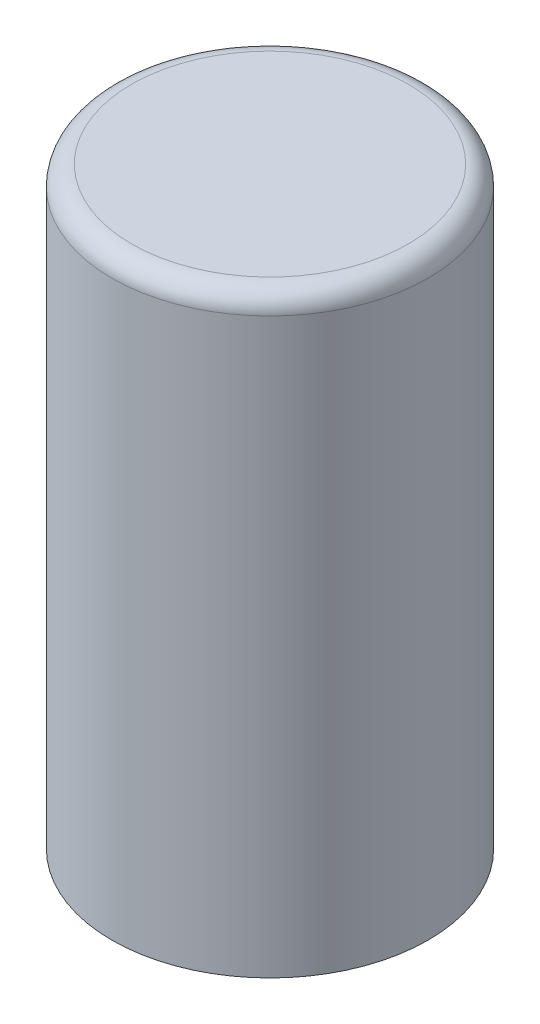
ISO-10303-21;
HEADER;
FILE_DESCRIPTION(('STEP AP214'),'2;1');
FILE_NAME('part.step','',(''),(''),'','','');
FILE_SCHEMA(('AUTOMOTIVE_DESIGN { 1 0 10303 214 1 1 1 1 }'));
ENDSEC;
DATA;
#1=APPLICATION_CONTEXT('core data for automotive mechanical design processes');
#2=APPLICATION_PROTOCOL_DEFINITION('international standard','automotive_design',2000,#1);
#3=PRODUCT_CONTEXT('',#1,'mechanical');
#4=PRODUCT('Part','Part','',(#3));
#5=PRODUCT_RELATED_PRODUCT_CATEGORY('part','',(#4));
#6=PRODUCT_DEFINITION_FORMATION('','',#4);
#7=PRODUCT_DEFINITION_CONTEXT('part definition',#1,'design');
#8=PRODUCT_DEFINITION('design','',#6,#7);
#9=PRODUCT_DEFINITION_SHAPE('','',#8);
#10=(LENGTH_UNIT() NAMED_UNIT(*) SI_UNIT(.MILLI.,.METRE.));
#11=(NAMED_UNIT(*) PLANE_ANGLE_UNIT() SI_UNIT($,.RADIAN.));
#12=(NAMED_UNIT(*) SI_UNIT($,.STERADIAN.) SOLID_ANGLE_UNIT());
#13=UNCERTAINTY_MEASURE_WITH_UNIT(LENGTH_MEASURE(1.E-05),#10,'distance_accuracy_value','');
#14=(GEOMETRIC_REPRESENTATION_CONTEXT(3) GLOBAL_UNCERTAINTY_ASSIGNED_CONTEXT((#13)) GLOBAL_UNIT_ASSIGNED_CONTEXT((#10,
#11,#12)) REPRESENTATION_CONTEXT('',''));
#15=CARTESIAN_POINT('',(0.,0.,0.));
#16=DIRECTION('',(0.,0.,1.));
#17=DIRECTION('',(1.,0.,0.));
#18=AXIS2_PLACEMENT_3D('',#15,#16,#17);
#19=CARTESIAN_POINT('',(0.,15.,0.));
#20=DIRECTION('',(0.,-1.,0.));
#21=DIRECTION('',(0.,0.,-1.));
#22=AXIS2_PLACEMENT_3D('',#19,#20,#21);
#23=CYLINDRICAL_SURFACE('',#22,4.);
#24=CARTESIAN_POINT('',(0.,14.5,0.));
#25=DIRECTION('',(0.,1.,0.));
#26=DIRECTION('',(0.,0.,1.));
#27=AXIS2_PLACEMENT_3D('',#24,#25,#26);
#28=CIRCLE('',#27,4.);
#29=CARTESIAN_POINT('',(0.,14.5,4.));
#30=VERTEX_POINT('',#29);
#31=EDGE_CURVE('E10',#30,#30,#28,.F.);
#32=ORIENTED_EDGE('',*,*,#31,.T.);
#33=EDGE_LOOP('',(#32));
#34=FACE_BOUND('',#33,.T.);
#35=CARTESIAN_POINT('',(0.,0.,0.));
#36=DIRECTION('',(0.,1.,0.));
#37=DIRECTION('',(0.,0.,1.));
#38=AXIS2_PLACEMENT_3D('',#35,#36,#37);
#39=CIRCLE('',#38,4.);
#40=CARTESIAN_POINT('',(0.,0.,4.));
#41=VERTEX_POINT('',#40);
#42=EDGE_CURVE('E41',#41,#41,#39,.T.);
#43=ORIENTED_EDGE('',*,*,#42,.T.);
#44=EDGE_LOOP('',(#43));
#45=FACE_BOUND('',#44,.T.);
#46=ADVANCED_FACE('F30',(#34,#45),#23,.T.);
#47=CARTESIAN_POINT('',(0.,15.,0.));
#48=DIRECTION('',(0.,1.,0.));
#49=DIRECTION('',(0.,0.,1.));
#50=AXIS2_PLACEMENT_3D('',#47,#48,#49);
#51=PLANE('',#50);
#52=CARTESIAN_POINT('',(0.,15.,0.));
#53=DIRECTION('',(0.,1.,0.));
#54=DIRECTION('',(0.,0.,1.));
#55=AXIS2_PLACEMENT_3D('',#52,#53,#54);
#56=CIRCLE('',#55,3.5);
#57=CARTESIAN_POINT('',(0.,15.,3.5));
#58=VERTEX_POINT('',#57);
#59=EDGE_CURVE('E37',#58,#58,#56,.T.);
#60=ORIENTED_EDGE('',*,*,#59,.T.);
#61=EDGE_LOOP('',(#60));
#62=FACE_BOUND('',#61,.T.);
#63=ADVANCED_FACE('F51',(#62),#51,.T.);
#64=CARTESIAN_POINT('',(0.,0.,0.));
#65=DIRECTION('',(0.,1.,0.));
#66=DIRECTION('',(0.,0.,1.));
#67=AXIS2_PLACEMENT_3D('',#64,#65,#66);
#68=PLANE('',#67);
#69=ORIENTED_EDGE('',*,*,#42,.F.);
#70=EDGE_LOOP('',(#69));
#71=FACE_BOUND('',#70,.T.);
#72=ADVANCED_FACE('F49',(#71),#68,.F.);
#73=CARTESIAN_POINT('',(0.,14.5,0.));
#74=DIRECTION('',(0.,1.,0.));
#75=DIRECTION('',(0.,0.,1.));
#76=AXIS2_PLACEMENT_3D('',#73,#74,#75);
#77=TOROIDAL_SURFACE('',#76,3.5,0.5);
#78=ORIENTED_EDGE('',*,*,#31,.F.);
#79=EDGE_LOOP('',(#78));
#80=FACE_BOUND('',#79,.T.);
#81=ORIENTED_EDGE('',*,*,#59,.F.);
#82=EDGE_LOOP('',(#81));
#83=FACE_BOUND('',#82,.T.);
#84=ADVANCED_FACE('F32',(#80,#83),#77,.T.);
#85=CLOSED_SHELL('',(#46,#63,#72,#84));
#86=MANIFOLD_SOLID_BREP('B2',#85);
#87=ADVANCED_BREP_SHAPE_REPRESENTATION('',(#18,#86),#14);
#88=SHAPE_DEFINITION_REPRESENTATION(#9,#87);
ENDSEC;
END-ISO-10303-21;
